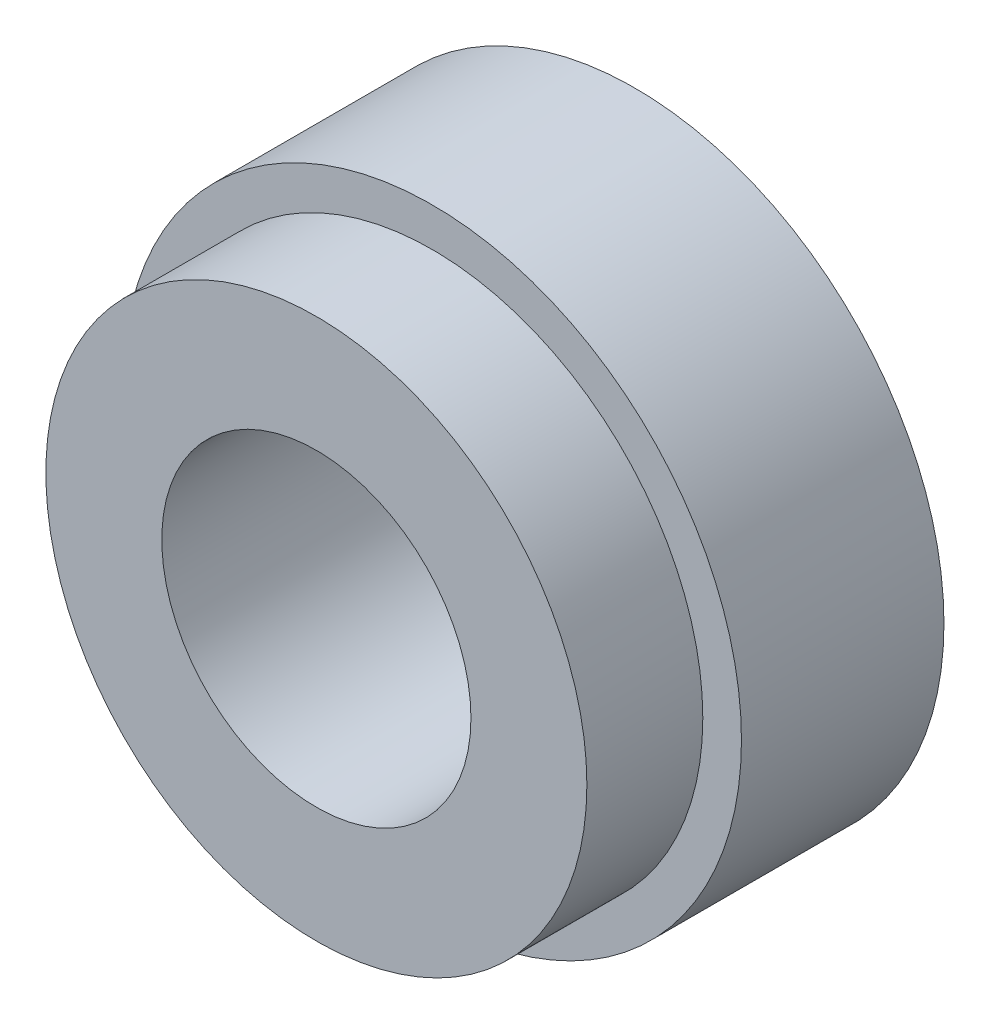
ISO-10303-21;
HEADER;
FILE_DESCRIPTION(('STEP AP214'),'2;1');
FILE_NAME('part.step','',(''),(''),'','','');
FILE_SCHEMA(('AUTOMOTIVE_DESIGN { 1 0 10303 214 1 1 1 1 }'));
ENDSEC;
DATA;
#1=APPLICATION_CONTEXT('core data for automotive mechanical design processes');
#2=APPLICATION_PROTOCOL_DEFINITION('international standard','automotive_design',2000,#1);
#3=PRODUCT_CONTEXT('',#1,'mechanical');
#4=PRODUCT('Part','Part','',(#3));
#5=PRODUCT_RELATED_PRODUCT_CATEGORY('part','',(#4));
#6=PRODUCT_DEFINITION_FORMATION('','',#4);
#7=PRODUCT_DEFINITION_CONTEXT('part definition',#1,'design');
#8=PRODUCT_DEFINITION('design','',#6,#7);
#9=PRODUCT_DEFINITION_SHAPE('','',#8);
#10=(LENGTH_UNIT() NAMED_UNIT(*) SI_UNIT(.MILLI.,.METRE.));
#11=(NAMED_UNIT(*) PLANE_ANGLE_UNIT() SI_UNIT($,.RADIAN.));
#12=(NAMED_UNIT(*) SI_UNIT($,.STERADIAN.) SOLID_ANGLE_UNIT());
#13=UNCERTAINTY_MEASURE_WITH_UNIT(LENGTH_MEASURE(1.E-05),#10,'distance_accuracy_value','');
#14=(GEOMETRIC_REPRESENTATION_CONTEXT(3) GLOBAL_UNCERTAINTY_ASSIGNED_CONTEXT((#13)) GLOBAL_UNIT_ASSIGNED_CONTEXT((#10,
#11,#12)) REPRESENTATION_CONTEXT('',''));
#15=CARTESIAN_POINT('',(0.,0.,0.));
#16=DIRECTION('',(0.,0.,1.));
#17=DIRECTION('',(1.,0.,0.));
#18=AXIS2_PLACEMENT_3D('',#15,#16,#17);
#19=CARTESIAN_POINT('',(0.,0.,33.274));
#20=DIRECTION('',(0.,0.,-1.));
#21=DIRECTION('',(-1.,0.,0.));
#22=AXIS2_PLACEMENT_3D('',#19,#20,#21);
#23=CYLINDRICAL_SURFACE('',#22,50.8);
#24=CARTESIAN_POINT('',(0.,0.,33.274));
#25=DIRECTION('',(0.,0.,1.));
#26=DIRECTION('',(1.,0.,0.));
#27=AXIS2_PLACEMENT_3D('',#24,#25,#26);
#28=CIRCLE('',#27,50.8);
#29=CARTESIAN_POINT('',(50.8,0.,33.274));
#30=VERTEX_POINT('',#29);
#31=EDGE_CURVE('E43',#30,#30,#28,.T.);
#32=ORIENTED_EDGE('',*,*,#31,.F.);
#33=EDGE_LOOP('',(#32));
#34=FACE_BOUND('',#33,.T.);
#35=CARTESIAN_POINT('',(0.,0.,0.));
#36=DIRECTION('',(0.,0.,1.));
#37=DIRECTION('',(1.,0.,0.));
#38=AXIS2_PLACEMENT_3D('',#35,#36,#37);
#39=CIRCLE('',#38,50.8);
#40=CARTESIAN_POINT('',(50.8,0.,0.));
#41=VERTEX_POINT('',#40);
#42=EDGE_CURVE('E39',#41,#41,#39,.T.);
#43=ORIENTED_EDGE('',*,*,#42,.T.);
#44=EDGE_LOOP('',(#43));
#45=FACE_BOUND('',#44,.T.);
#46=ADVANCED_FACE('F36',(#34,#45),#23,.T.);
#47=CARTESIAN_POINT('',(0.,0.,33.274));
#48=DIRECTION('',(0.,0.,1.));
#49=DIRECTION('',(1.,0.,0.));
#50=AXIS2_PLACEMENT_3D('',#47,#48,#49);
#51=PLANE('',#50);
#52=CARTESIAN_POINT('',(0.,0.,33.274));
#53=DIRECTION('',(0.,0.,1.));
#54=DIRECTION('',(1.,0.,0.));
#55=AXIS2_PLACEMENT_3D('',#52,#53,#54);
#56=CIRCLE('',#55,44.45);
#57=CARTESIAN_POINT('',(44.45,0.,33.274));
#58=VERTEX_POINT('',#57);
#59=EDGE_CURVE('E10',#58,#58,#56,.T.);
#60=ORIENTED_EDGE('',*,*,#59,.F.);
#61=EDGE_LOOP('',(#60));
#62=FACE_BOUND('',#61,.T.);
#63=ORIENTED_EDGE('',*,*,#31,.T.);
#64=EDGE_LOOP('',(#63));
#65=FACE_BOUND('',#64,.T.);
#66=ADVANCED_FACE('F75',(#62,#65),#51,.T.);
#67=CARTESIAN_POINT('',(0.,0.,0.));
#68=DIRECTION('',(0.,0.,1.));
#69=DIRECTION('',(1.,0.,0.));
#70=AXIS2_PLACEMENT_3D('',#67,#68,#69);
#71=PLANE('',#70);
#72=CARTESIAN_POINT('',(0.,0.,0.));
#73=DIRECTION('',(0.,0.,1.));
#74=DIRECTION('',(1.,0.,0.));
#75=AXIS2_PLACEMENT_3D('',#72,#73,#74);
#76=CIRCLE('',#75,25.4);
#77=CARTESIAN_POINT('',(25.4,0.,0.));
#78=VERTEX_POINT('',#77);
#79=EDGE_CURVE('E53',#78,#78,#76,.T.);
#80=ORIENTED_EDGE('',*,*,#79,.T.);
#81=EDGE_LOOP('',(#80));
#82=FACE_BOUND('',#81,.T.);
#83=ORIENTED_EDGE('',*,*,#42,.F.);
#84=EDGE_LOOP('',(#83));
#85=FACE_BOUND('',#84,.T.);
#86=ADVANCED_FACE('F70',(#82,#85),#71,.F.);
#87=CARTESIAN_POINT('',(0.,0.,52.324));
#88=DIRECTION('',(0.,0.,-1.));
#89=DIRECTION('',(-1.,0.,0.));
#90=AXIS2_PLACEMENT_3D('',#87,#88,#89);
#91=CYLINDRICAL_SURFACE('',#90,44.45);
#92=CARTESIAN_POINT('',(0.,0.,52.324));
#93=DIRECTION('',(0.,0.,1.));
#94=DIRECTION('',(1.,0.,0.));
#95=AXIS2_PLACEMENT_3D('',#92,#93,#94);
#96=CIRCLE('',#95,44.45);
#97=CARTESIAN_POINT('',(44.45,0.,52.324));
#98=VERTEX_POINT('',#97);
#99=EDGE_CURVE('E49',#98,#98,#96,.T.);
#100=ORIENTED_EDGE('',*,*,#99,.F.);
#101=EDGE_LOOP('',(#100));
#102=FACE_BOUND('',#101,.T.);
#103=ORIENTED_EDGE('',*,*,#59,.T.);
#104=EDGE_LOOP('',(#103));
#105=FACE_BOUND('',#104,.T.);
#106=ADVANCED_FACE('F65',(#102,#105),#91,.T.);
#107=CARTESIAN_POINT('',(0.,0.,52.324));
#108=DIRECTION('',(0.,0.,1.));
#109=DIRECTION('',(1.,0.,0.));
#110=AXIS2_PLACEMENT_3D('',#107,#108,#109);
#111=PLANE('',#110);
#112=CARTESIAN_POINT('',(0.,0.,52.324));
#113=DIRECTION('',(0.,0.,1.));
#114=DIRECTION('',(1.,0.,0.));
#115=AXIS2_PLACEMENT_3D('',#112,#113,#114);
#116=CIRCLE('',#115,25.4);
#117=CARTESIAN_POINT('',(25.4,0.,52.324));
#118=VERTEX_POINT('',#117);
#119=EDGE_CURVE('E52',#118,#118,#116,.T.);
#120=ORIENTED_EDGE('',*,*,#119,.F.);
#121=EDGE_LOOP('',(#120));
#122=FACE_BOUND('',#121,.T.);
#123=ORIENTED_EDGE('',*,*,#99,.T.);
#124=EDGE_LOOP('',(#123));
#125=FACE_BOUND('',#124,.T.);
#126=ADVANCED_FACE('F62',(#122,#125),#111,.T.);
#127=CARTESIAN_POINT('',(0.,0.,52.324));
#128=DIRECTION('',(0.,0.,-1.));
#129=DIRECTION('',(-1.,0.,0.));
#130=AXIS2_PLACEMENT_3D('',#127,#128,#129);
#131=CYLINDRICAL_SURFACE('',#130,25.4);
#132=ORIENTED_EDGE('',*,*,#119,.T.);
#133=EDGE_LOOP('',(#132));
#134=FACE_BOUND('',#133,.T.);
#135=ORIENTED_EDGE('',*,*,#79,.F.);
#136=EDGE_LOOP('',(#135));
#137=FACE_BOUND('',#136,.T.);
#138=ADVANCED_FACE('F59',(#134,#137),#131,.F.);
#139=CLOSED_SHELL('',(#46,#66,#86,#106,#126,#138));
#140=MANIFOLD_SOLID_BREP('B2',#139);
#141=ADVANCED_BREP_SHAPE_REPRESENTATION('',(#18,#140),#14);
#142=SHAPE_DEFINITION_REPRESENTATION(#9,#141);
ENDSEC;
END-ISO-10303-21;
